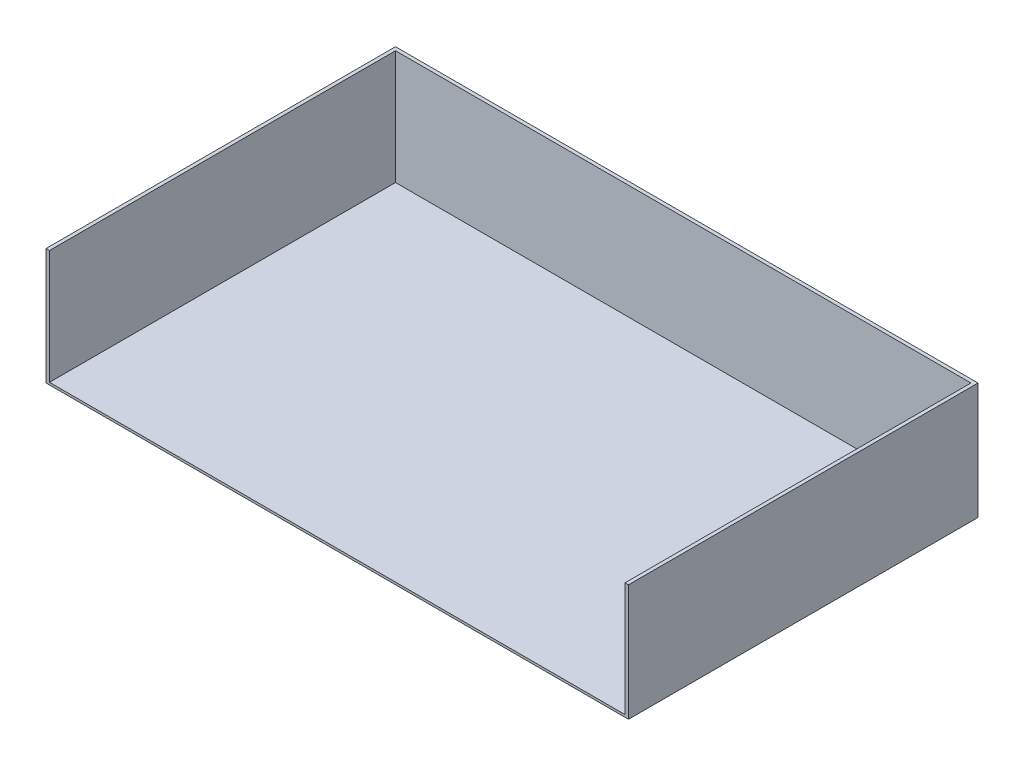
ISO-10303-21;
HEADER;
FILE_DESCRIPTION(('STEP AP214'),'2;1');
FILE_NAME('part.step','',(''),(''),'','','');
FILE_SCHEMA(('AUTOMOTIVE_DESIGN { 1 0 10303 214 1 1 1 1 }'));
ENDSEC;
DATA;
#1=APPLICATION_CONTEXT('core data for automotive mechanical design processes');
#2=APPLICATION_PROTOCOL_DEFINITION('international standard','automotive_design',2000,#1);
#3=PRODUCT_CONTEXT('',#1,'mechanical');
#4=PRODUCT('Part','Part','',(#3));
#5=PRODUCT_RELATED_PRODUCT_CATEGORY('part','',(#4));
#6=PRODUCT_DEFINITION_FORMATION('','',#4);
#7=PRODUCT_DEFINITION_CONTEXT('part definition',#1,'design');
#8=PRODUCT_DEFINITION('design','',#6,#7);
#9=PRODUCT_DEFINITION_SHAPE('','',#8);
#10=(LENGTH_UNIT() NAMED_UNIT(*) SI_UNIT(.MILLI.,.METRE.));
#11=(NAMED_UNIT(*) PLANE_ANGLE_UNIT() SI_UNIT($,.RADIAN.));
#12=(NAMED_UNIT(*) SI_UNIT($,.STERADIAN.) SOLID_ANGLE_UNIT());
#13=UNCERTAINTY_MEASURE_WITH_UNIT(LENGTH_MEASURE(1.E-05),#10,'distance_accuracy_value','');
#14=(GEOMETRIC_REPRESENTATION_CONTEXT(3) GLOBAL_UNCERTAINTY_ASSIGNED_CONTEXT((#13)) GLOBAL_UNIT_ASSIGNED_CONTEXT((#10,
#11,#12)) REPRESENTATION_CONTEXT('',''));
#15=CARTESIAN_POINT('',(0.,0.,0.));
#16=DIRECTION('',(0.,0.,1.));
#17=DIRECTION('',(1.,0.,0.));
#18=AXIS2_PLACEMENT_3D('',#15,#16,#17);
#19=CARTESIAN_POINT('',(0.,0.,381.));
#20=DIRECTION('',(1.,0.,0.));
#21=DIRECTION('',(0.,0.,-1.));
#22=AXIS2_PLACEMENT_3D('',#19,#20,#21);
#23=PLANE('',#22);
#24=DIRECTION('',(0.,-1.,0.));
#25=VECTOR('',#24,1.);
#26=CARTESIAN_POINT('',(0.,0.,0.));
#27=LINE('',#26,#25);
#28=CARTESIAN_POINT('',(0.,127.,0.));
#29=VERTEX_POINT('',#28);
#30=CARTESIAN_POINT('',(0.,0.,0.));
#31=VERTEX_POINT('',#30);
#32=EDGE_CURVE('E146',#29,#31,#27,.T.);
#33=ORIENTED_EDGE('',*,*,#32,.T.);
#34=DIRECTION('',(0.,0.,-1.));
#35=VECTOR('',#34,1.);
#36=CARTESIAN_POINT('',(0.,0.,381.));
#37=LINE('',#36,#35);
#38=CARTESIAN_POINT('',(0.,0.,381.));
#39=VERTEX_POINT('',#38);
#40=EDGE_CURVE('E12',#39,#31,#37,.T.);
#41=ORIENTED_EDGE('',*,*,#40,.F.);
#42=DIRECTION('',(0.,-1.,0.));
#43=VECTOR('',#42,1.);
#44=CARTESIAN_POINT('',(0.,0.,381.));
#45=LINE('',#44,#43);
#46=CARTESIAN_POINT('',(0.,127.,381.));
#47=VERTEX_POINT('',#46);
#48=EDGE_CURVE('E153',#47,#39,#45,.T.);
#49=ORIENTED_EDGE('',*,*,#48,.F.);
#50=DIRECTION('',(0.,0.,-1.));
#51=VECTOR('',#50,1.);
#52=CARTESIAN_POINT('',(0.,127.,381.));
#53=LINE('',#52,#51);
#54=EDGE_CURVE('E139',#47,#29,#53,.T.);
#55=ORIENTED_EDGE('',*,*,#54,.T.);
#56=EDGE_LOOP('',(#33,#41,#49,#55));
#57=FACE_BOUND('',#56,.T.);
#58=ADVANCED_FACE('F41',(#57),#23,.F.);
#59=CARTESIAN_POINT('',(0.,0.,381.));
#60=DIRECTION('',(0.,1.,0.));
#61=DIRECTION('',(0.,0.,1.));
#62=AXIS2_PLACEMENT_3D('',#59,#60,#61);
#63=PLANE('',#62);
#64=DIRECTION('',(1.,0.,0.));
#65=VECTOR('',#64,1.);
#66=CARTESIAN_POINT('',(0.,0.,0.));
#67=LINE('',#66,#65);
#68=CARTESIAN_POINT('',(635.,0.,0.));
#69=VERTEX_POINT('',#68);
#70=EDGE_CURVE('E149',#31,#69,#67,.T.);
#71=ORIENTED_EDGE('',*,*,#70,.T.);
#72=DIRECTION('',(0.,0.,-1.));
#73=VECTOR('',#72,1.);
#74=CARTESIAN_POINT('',(635.,0.,381.));
#75=LINE('',#74,#73);
#76=CARTESIAN_POINT('',(635.,0.,381.));
#77=VERTEX_POINT('',#76);
#78=EDGE_CURVE('E48',#77,#69,#75,.T.);
#79=ORIENTED_EDGE('',*,*,#78,.F.);
#80=DIRECTION('',(1.,0.,0.));
#81=VECTOR('',#80,1.);
#82=CARTESIAN_POINT('',(0.,0.,381.));
#83=LINE('',#82,#81);
#84=EDGE_CURVE('E92',#39,#77,#83,.T.);
#85=ORIENTED_EDGE('',*,*,#84,.F.);
#86=ORIENTED_EDGE('',*,*,#40,.T.);
#87=EDGE_LOOP('',(#71,#79,#85,#86));
#88=FACE_BOUND('',#87,.T.);
#89=ADVANCED_FACE('F197',(#88),#63,.F.);
#90=CARTESIAN_POINT('',(635.,0.,381.));
#91=DIRECTION('',(-1.,0.,0.));
#92=DIRECTION('',(0.,0.,1.));
#93=AXIS2_PLACEMENT_3D('',#90,#91,#92);
#94=PLANE('',#93);
#95=DIRECTION('',(0.,1.,0.));
#96=VECTOR('',#95,1.);
#97=CARTESIAN_POINT('',(635.,0.,0.));
#98=LINE('',#97,#96);
#99=CARTESIAN_POINT('',(635.,127.,0.));
#100=VERTEX_POINT('',#99);
#101=EDGE_CURVE('E151',#69,#100,#98,.T.);
#102=ORIENTED_EDGE('',*,*,#101,.T.);
#103=DIRECTION('',(0.,0.,-1.));
#104=VECTOR('',#103,1.);
#105=CARTESIAN_POINT('',(635.,127.,381.));
#106=LINE('',#105,#104);
#107=CARTESIAN_POINT('',(635.,127.,381.));
#108=VERTEX_POINT('',#107);
#109=EDGE_CURVE('E141',#108,#100,#106,.T.);
#110=ORIENTED_EDGE('',*,*,#109,.F.);
#111=DIRECTION('',(0.,1.,0.));
#112=VECTOR('',#111,1.);
#113=CARTESIAN_POINT('',(635.,0.,381.));
#114=LINE('',#113,#112);
#115=EDGE_CURVE('E137',#77,#108,#114,.T.);
#116=ORIENTED_EDGE('',*,*,#115,.F.);
#117=ORIENTED_EDGE('',*,*,#78,.T.);
#118=EDGE_LOOP('',(#102,#110,#116,#117));
#119=FACE_BOUND('',#118,.T.);
#120=ADVANCED_FACE('F158',(#119),#94,.F.);
#121=CARTESIAN_POINT('',(0.,127.,381.));
#122=DIRECTION('',(0.,-1.,0.));
#123=DIRECTION('',(0.,0.,-1.));
#124=AXIS2_PLACEMENT_3D('',#121,#122,#123);
#125=PLANE('',#124);
#126=DIRECTION('',(-1.,0.,0.));
#127=VECTOR('',#126,1.);
#128=CARTESIAN_POINT('',(0.,127.,381.));
#129=LINE('',#128,#127);
#130=CARTESIAN_POINT('',(3.80999999999998,127.,381.));
#131=VERTEX_POINT('',#130);
#132=EDGE_CURVE('E63',#131,#47,#129,.T.);
#133=ORIENTED_EDGE('',*,*,#132,.F.);
#134=DIRECTION('',(0.,0.,1.));
#135=VECTOR('',#134,1.);
#136=CARTESIAN_POINT('',(3.80999999999998,127.,381.));
#137=LINE('',#136,#135);
#138=CARTESIAN_POINT('',(3.81,127.,3.81));
#139=VERTEX_POINT('',#138);
#140=EDGE_CURVE('E126',#139,#131,#137,.T.);
#141=ORIENTED_EDGE('',*,*,#140,.F.);
#142=DIRECTION('',(-1.,0.,0.));
#143=VECTOR('',#142,1.);
#144=CARTESIAN_POINT('',(3.81,127.,3.81));
#145=LINE('',#144,#143);
#146=CARTESIAN_POINT('',(631.19,127.,3.81));
#147=VERTEX_POINT('',#146);
#148=EDGE_CURVE('E133',#147,#139,#145,.T.);
#149=ORIENTED_EDGE('',*,*,#148,.F.);
#150=DIRECTION('',(0.,0.,-1.));
#151=VECTOR('',#150,1.);
#152=CARTESIAN_POINT('',(631.19,127.,3.81));
#153=LINE('',#152,#151);
#154=CARTESIAN_POINT('',(631.19,127.,381.));
#155=VERTEX_POINT('',#154);
#156=EDGE_CURVE('E118',#155,#147,#153,.T.);
#157=ORIENTED_EDGE('',*,*,#156,.F.);
#158=EDGE_CURVE('E130',#108,#155,#129,.T.);
#159=ORIENTED_EDGE('',*,*,#158,.F.);
#160=ORIENTED_EDGE('',*,*,#109,.T.);
#161=DIRECTION('',(-1.,0.,0.));
#162=VECTOR('',#161,1.);
#163=CARTESIAN_POINT('',(0.,127.,0.));
#164=LINE('',#163,#162);
#165=EDGE_CURVE('E85',#100,#29,#164,.T.);
#166=ORIENTED_EDGE('',*,*,#165,.T.);
#167=ORIENTED_EDGE('',*,*,#54,.F.);
#168=EDGE_LOOP('',(#133,#141,#149,#157,#159,#160,#166,#167));
#169=FACE_BOUND('',#168,.T.);
#170=ADVANCED_FACE('F129',(#169),#125,.F.);
#171=CARTESIAN_POINT('',(0.,0.,381.));
#172=DIRECTION('',(0.,0.,-1.));
#173=DIRECTION('',(-1.,0.,0.));
#174=AXIS2_PLACEMENT_3D('',#171,#172,#173);
#175=PLANE('',#174);
#176=DIRECTION('',(-1.,0.,0.));
#177=VECTOR('',#176,1.);
#178=CARTESIAN_POINT('',(631.19,2.53999999999999,381.));
#179=LINE('',#178,#177);
#180=CARTESIAN_POINT('',(631.19,2.53999999999999,381.));
#181=VERTEX_POINT('',#180);
#182=CARTESIAN_POINT('',(3.80999999999998,2.54,381.));
#183=VERTEX_POINT('',#182);
#184=EDGE_CURVE('E174',#181,#183,#179,.T.);
#185=ORIENTED_EDGE('',*,*,#184,.T.);
#186=DIRECTION('',(0.,1.,0.));
#187=VECTOR('',#186,1.);
#188=CARTESIAN_POINT('',(3.80999999999998,-732.036857337115,381.));
#189=LINE('',#188,#187);
#190=EDGE_CURVE('E55',#183,#131,#189,.T.);
#191=ORIENTED_EDGE('',*,*,#190,.T.);
#192=ORIENTED_EDGE('',*,*,#132,.T.);
#193=ORIENTED_EDGE('',*,*,#48,.T.);
#194=ORIENTED_EDGE('',*,*,#84,.T.);
#195=ORIENTED_EDGE('',*,*,#115,.T.);
#196=ORIENTED_EDGE('',*,*,#158,.T.);
#197=DIRECTION('',(0.,1.,0.));
#198=VECTOR('',#197,1.);
#199=CARTESIAN_POINT('',(631.19,-732.036857337115,381.));
#200=LINE('',#199,#198);
#201=EDGE_CURVE('E114',#181,#155,#200,.T.);
#202=ORIENTED_EDGE('',*,*,#201,.F.);
#203=EDGE_LOOP('',(#185,#191,#192,#193,#194,#195,#196,#202));
#204=FACE_BOUND('',#203,.T.);
#205=ADVANCED_FACE('F135',(#204),#175,.F.);
#206=CARTESIAN_POINT('',(0.,0.,0.));
#207=DIRECTION('',(0.,0.,-1.));
#208=DIRECTION('',(-1.,0.,0.));
#209=AXIS2_PLACEMENT_3D('',#206,#207,#208);
#210=PLANE('',#209);
#211=ORIENTED_EDGE('',*,*,#32,.F.);
#212=ORIENTED_EDGE('',*,*,#165,.F.);
#213=ORIENTED_EDGE('',*,*,#101,.F.);
#214=ORIENTED_EDGE('',*,*,#70,.F.);
#215=EDGE_LOOP('',(#211,#212,#213,#214));
#216=FACE_BOUND('',#215,.T.);
#217=ADVANCED_FACE('F161',(#216),#210,.T.);
#218=CARTESIAN_POINT('',(3.80999999999998,-732.036857337115,381.));
#219=DIRECTION('',(-1.,0.,0.));
#220=DIRECTION('',(0.,0.,1.));
#221=AXIS2_PLACEMENT_3D('',#218,#219,#220);
#222=PLANE('',#221);
#223=DIRECTION('',(0.,0.,-1.));
#224=VECTOR('',#223,1.);
#225=CARTESIAN_POINT('',(3.80999999999998,2.53999999999999,381.));
#226=LINE('',#225,#224);
#227=CARTESIAN_POINT('',(3.81,2.53999999999999,3.81));
#228=VERTEX_POINT('',#227);
#229=EDGE_CURVE('E175',#183,#228,#226,.T.);
#230=ORIENTED_EDGE('',*,*,#229,.T.);
#231=DIRECTION('',(0.,1.,0.));
#232=VECTOR('',#231,1.);
#233=CARTESIAN_POINT('',(3.81,-732.036857337115,3.81));
#234=LINE('',#233,#232);
#235=EDGE_CURVE('E170',#228,#139,#234,.T.);
#236=ORIENTED_EDGE('',*,*,#235,.T.);
#237=ORIENTED_EDGE('',*,*,#140,.T.);
#238=ORIENTED_EDGE('',*,*,#190,.F.);
#239=EDGE_LOOP('',(#230,#236,#237,#238));
#240=FACE_BOUND('',#239,.T.);
#241=ADVANCED_FACE('F185',(#240),#222,.F.);
#242=CARTESIAN_POINT('',(3.81,-732.036857337115,3.81));
#243=DIRECTION('',(0.,0.,-1.));
#244=DIRECTION('',(-1.,0.,0.));
#245=AXIS2_PLACEMENT_3D('',#242,#243,#244);
#246=PLANE('',#245);
#247=DIRECTION('',(1.,0.,0.));
#248=VECTOR('',#247,1.);
#249=CARTESIAN_POINT('',(3.81,2.53999999999999,3.81));
#250=LINE('',#249,#248);
#251=CARTESIAN_POINT('',(631.19,2.53999999999999,3.81));
#252=VERTEX_POINT('',#251);
#253=EDGE_CURVE('E169',#228,#252,#250,.T.);
#254=ORIENTED_EDGE('',*,*,#253,.T.);
#255=DIRECTION('',(0.,1.,0.));
#256=VECTOR('',#255,1.);
#257=CARTESIAN_POINT('',(631.19,-732.036857337115,3.81));
#258=LINE('',#257,#256);
#259=EDGE_CURVE('E125',#252,#147,#258,.T.);
#260=ORIENTED_EDGE('',*,*,#259,.T.);
#261=ORIENTED_EDGE('',*,*,#148,.T.);
#262=ORIENTED_EDGE('',*,*,#235,.F.);
#263=EDGE_LOOP('',(#254,#260,#261,#262));
#264=FACE_BOUND('',#263,.T.);
#265=ADVANCED_FACE('F182',(#264),#246,.F.);
#266=CARTESIAN_POINT('',(631.19,-732.036857337115,3.81));
#267=DIRECTION('',(1.,0.,0.));
#268=DIRECTION('',(0.,0.,-1.));
#269=AXIS2_PLACEMENT_3D('',#266,#267,#268);
#270=PLANE('',#269);
#271=DIRECTION('',(0.,0.,1.));
#272=VECTOR('',#271,1.);
#273=CARTESIAN_POINT('',(631.19,2.53999999999999,3.81));
#274=LINE('',#273,#272);
#275=EDGE_CURVE('E121',#252,#181,#274,.T.);
#276=ORIENTED_EDGE('',*,*,#275,.T.);
#277=ORIENTED_EDGE('',*,*,#201,.T.);
#278=ORIENTED_EDGE('',*,*,#156,.T.);
#279=ORIENTED_EDGE('',*,*,#259,.F.);
#280=EDGE_LOOP('',(#276,#277,#278,#279));
#281=FACE_BOUND('',#280,.T.);
#282=ADVANCED_FACE('F116',(#281),#270,.F.);
#283=CARTESIAN_POINT('',(0.,2.54,381.));
#284=DIRECTION('',(0.,1.,0.));
#285=DIRECTION('',(0.,0.,1.));
#286=AXIS2_PLACEMENT_3D('',#283,#284,#285);
#287=PLANE('',#286);
#288=ORIENTED_EDGE('',*,*,#184,.F.);
#289=ORIENTED_EDGE('',*,*,#275,.F.);
#290=ORIENTED_EDGE('',*,*,#253,.F.);
#291=ORIENTED_EDGE('',*,*,#229,.F.);
#292=EDGE_LOOP('',(#288,#289,#290,#291));
#293=FACE_BOUND('',#292,.T.);
#294=ADVANCED_FACE('F184',(#293),#287,.T.);
#295=CLOSED_SHELL('',(#58,#89,#120,#170,#205,#217,#241,#265,#282,#294));
#296=MANIFOLD_SOLID_BREP('B2',#295);
#297=ADVANCED_BREP_SHAPE_REPRESENTATION('',(#18,#296),#14);
#298=SHAPE_DEFINITION_REPRESENTATION(#9,#297);
ENDSEC;
END-ISO-10303-21;
